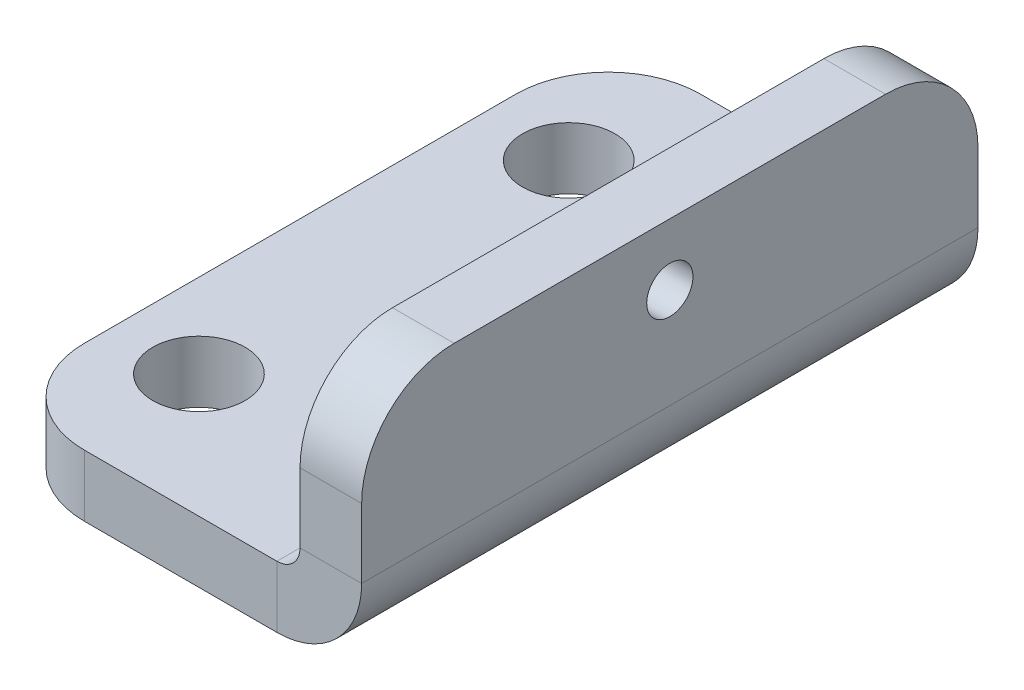
ISO-10303-21;
HEADER;
FILE_DESCRIPTION(('STEP AP214'),'2;1');
FILE_NAME('part.step','',(''),(''),'','','');
FILE_SCHEMA(('AUTOMOTIVE_DESIGN { 1 0 10303 214 1 1 1 1 }'));
ENDSEC;
DATA;
#1=APPLICATION_CONTEXT('core data for automotive mechanical design processes');
#2=APPLICATION_PROTOCOL_DEFINITION('international standard','automotive_design',2000,#1);
#3=PRODUCT_CONTEXT('',#1,'mechanical');
#4=PRODUCT('Part','Part','',(#3));
#5=PRODUCT_RELATED_PRODUCT_CATEGORY('part','',(#4));
#6=PRODUCT_DEFINITION_FORMATION('','',#4);
#7=PRODUCT_DEFINITION_CONTEXT('part definition',#1,'design');
#8=PRODUCT_DEFINITION('design','',#6,#7);
#9=PRODUCT_DEFINITION_SHAPE('','',#8);
#10=(LENGTH_UNIT() NAMED_UNIT(*) SI_UNIT(.MILLI.,.METRE.));
#11=(NAMED_UNIT(*) PLANE_ANGLE_UNIT() SI_UNIT($,.RADIAN.));
#12=(NAMED_UNIT(*) SI_UNIT($,.STERADIAN.) SOLID_ANGLE_UNIT());
#13=UNCERTAINTY_MEASURE_WITH_UNIT(LENGTH_MEASURE(1.E-05),#10,'distance_accuracy_value','');
#14=(GEOMETRIC_REPRESENTATION_CONTEXT(3) GLOBAL_UNCERTAINTY_ASSIGNED_CONTEXT((#13)) GLOBAL_UNIT_ASSIGNED_CONTEXT((#10,
#11,#12)) REPRESENTATION_CONTEXT('',''));
#15=CARTESIAN_POINT('',(0.,0.,0.));
#16=DIRECTION('',(0.,0.,1.));
#17=DIRECTION('',(1.,0.,0.));
#18=AXIS2_PLACEMENT_3D('',#15,#16,#17);
#19=CARTESIAN_POINT('',(3.,2.,7.));
#20=DIRECTION('',(0.,1.,0.));
#21=DIRECTION('',(0.,0.,1.));
#22=AXIS2_PLACEMENT_3D('',#19,#20,#21);
#23=PLANE('',#22);
#24=CARTESIAN_POINT('',(2.72,2.,-6.));
#25=DIRECTION('',(0.,1.,0.));
#26=DIRECTION('',(0.,0.,1.));
#27=AXIS2_PLACEMENT_3D('',#24,#25,#26);
#28=CIRCLE('',#27,1.5);
#29=CARTESIAN_POINT('',(2.72,2.,-4.5));
#30=VERTEX_POINT('',#29);
#31=EDGE_CURVE('E221',#30,#30,#28,.T.);
#32=ORIENTED_EDGE('',*,*,#31,.F.);
#33=EDGE_LOOP('',(#32));
#34=FACE_BOUND('',#33,.T.);
#35=CARTESIAN_POINT('',(2.72,2.,6.));
#36=DIRECTION('',(0.,1.,0.));
#37=DIRECTION('',(0.,0.,1.));
#38=AXIS2_PLACEMENT_3D('',#35,#36,#37);
#39=CIRCLE('',#38,1.5);
#40=CARTESIAN_POINT('',(2.72,2.,7.5));
#41=VERTEX_POINT('',#40);
#42=EDGE_CURVE('E215',#41,#41,#39,.T.);
#43=ORIENTED_EDGE('',*,*,#42,.F.);
#44=EDGE_LOOP('',(#43));
#45=FACE_BOUND('',#44,.T.);
#46=DIRECTION('',(1.,0.,0.));
#47=VECTOR('',#46,1.);
#48=CARTESIAN_POINT('',(3.,2.,10.));
#49=LINE('',#48,#47);
#50=CARTESIAN_POINT('',(3.,2.,10.));
#51=VERTEX_POINT('',#50);
#52=CARTESIAN_POINT('',(9.25,2.,10.));
#53=VERTEX_POINT('',#52);
#54=EDGE_CURVE('E236',#51,#53,#49,.T.);
#55=ORIENTED_EDGE('',*,*,#54,.T.);
#56=DIRECTION('',(0.,0.,-1.));
#57=VECTOR('',#56,1.);
#58=CARTESIAN_POINT('',(9.25,2.,-10.));
#59=LINE('',#58,#57);
#60=CARTESIAN_POINT('',(9.25,2.,-10.));
#61=VERTEX_POINT('',#60);
#62=EDGE_CURVE('E205',#61,#53,#59,.F.);
#63=ORIENTED_EDGE('',*,*,#62,.F.);
#64=DIRECTION('',(-1.,0.,0.));
#65=VECTOR('',#64,1.);
#66=CARTESIAN_POINT('',(3.,2.,-10.));
#67=LINE('',#66,#65);
#68=CARTESIAN_POINT('',(3.,2.,-10.));
#69=VERTEX_POINT('',#68);
#70=EDGE_CURVE('E227',#61,#69,#67,.T.);
#71=ORIENTED_EDGE('',*,*,#70,.T.);
#72=CARTESIAN_POINT('',(3.,2.,-7.));
#73=DIRECTION('',(0.,1.,0.));
#74=DIRECTION('',(0.,0.,-1.));
#75=AXIS2_PLACEMENT_3D('',#72,#73,#74);
#76=CIRCLE('',#75,3.);
#77=CARTESIAN_POINT('',(0.,2.,-7.));
#78=VERTEX_POINT('',#77);
#79=EDGE_CURVE('E229',#69,#78,#76,.T.);
#80=ORIENTED_EDGE('',*,*,#79,.T.);
#81=DIRECTION('',(0.,0.,1.));
#82=VECTOR('',#81,1.);
#83=CARTESIAN_POINT('',(0.,2.,-7.));
#84=LINE('',#83,#82);
#85=CARTESIAN_POINT('',(0.,2.,7.));
#86=VERTEX_POINT('',#85);
#87=EDGE_CURVE('E232',#78,#86,#84,.T.);
#88=ORIENTED_EDGE('',*,*,#87,.T.);
#89=CARTESIAN_POINT('',(3.,2.,7.));
#90=DIRECTION('',(0.,1.,0.));
#91=DIRECTION('',(0.,0.,1.));
#92=AXIS2_PLACEMENT_3D('',#89,#90,#91);
#93=CIRCLE('',#92,3.);
#94=EDGE_CURVE('E234',#86,#51,#93,.T.);
#95=ORIENTED_EDGE('',*,*,#94,.T.);
#96=EDGE_LOOP('',(#55,#63,#71,#80,#88,#95));
#97=FACE_BOUND('',#96,.T.);
#98=ADVANCED_FACE('F61',(#34,#45,#97),#23,.T.);
#99=CARTESIAN_POINT('',(3.,0.,7.));
#100=DIRECTION('',(0.,1.,0.));
#101=DIRECTION('',(0.,0.,1.));
#102=AXIS2_PLACEMENT_3D('',#99,#100,#101);
#103=PLANE('',#102);
#104=CARTESIAN_POINT('',(2.72,0.,6.));
#105=DIRECTION('',(0.,1.,0.));
#106=DIRECTION('',(0.,0.,1.));
#107=AXIS2_PLACEMENT_3D('',#104,#105,#106);
#108=CIRCLE('',#107,1.5);
#109=CARTESIAN_POINT('',(2.72,0.,7.5));
#110=VERTEX_POINT('',#109);
#111=EDGE_CURVE('E212',#110,#110,#108,.T.);
#112=ORIENTED_EDGE('',*,*,#111,.T.);
#113=EDGE_LOOP('',(#112));
#114=FACE_BOUND('',#113,.T.);
#115=CARTESIAN_POINT('',(2.72,0.,-6.));
#116=DIRECTION('',(0.,1.,0.));
#117=DIRECTION('',(0.,0.,1.));
#118=AXIS2_PLACEMENT_3D('',#115,#116,#117);
#119=CIRCLE('',#118,1.5);
#120=CARTESIAN_POINT('',(2.72,0.,-4.5));
#121=VERTEX_POINT('',#120);
#122=EDGE_CURVE('E218',#121,#121,#119,.T.);
#123=ORIENTED_EDGE('',*,*,#122,.T.);
#124=EDGE_LOOP('',(#123));
#125=FACE_BOUND('',#124,.T.);
#126=DIRECTION('',(0.,0.,-1.));
#127=VECTOR('',#126,1.);
#128=CARTESIAN_POINT('',(9.25,0.,-10.));
#129=LINE('',#128,#127);
#130=CARTESIAN_POINT('',(9.25,0.,-10.));
#131=VERTEX_POINT('',#130);
#132=CARTESIAN_POINT('',(9.25,0.,10.));
#133=VERTEX_POINT('',#132);
#134=EDGE_CURVE('E161',#131,#133,#129,.F.);
#135=ORIENTED_EDGE('',*,*,#134,.T.);
#136=DIRECTION('',(1.,0.,0.));
#137=VECTOR('',#136,1.);
#138=CARTESIAN_POINT('',(3.,0.,10.));
#139=LINE('',#138,#137);
#140=CARTESIAN_POINT('',(3.,0.,10.));
#141=VERTEX_POINT('',#140);
#142=EDGE_CURVE('E230',#141,#133,#139,.T.);
#143=ORIENTED_EDGE('',*,*,#142,.F.);
#144=CARTESIAN_POINT('',(3.,0.,7.));
#145=DIRECTION('',(0.,1.,0.));
#146=DIRECTION('',(0.,0.,1.));
#147=AXIS2_PLACEMENT_3D('',#144,#145,#146);
#148=CIRCLE('',#147,3.);
#149=CARTESIAN_POINT('',(0.,0.,7.));
#150=VERTEX_POINT('',#149);
#151=EDGE_CURVE('E245',#150,#141,#148,.T.);
#152=ORIENTED_EDGE('',*,*,#151,.F.);
#153=DIRECTION('',(0.,0.,1.));
#154=VECTOR('',#153,1.);
#155=CARTESIAN_POINT('',(0.,0.,-7.));
#156=LINE('',#155,#154);
#157=CARTESIAN_POINT('',(0.,0.,-7.));
#158=VERTEX_POINT('',#157);
#159=EDGE_CURVE('E243',#158,#150,#156,.T.);
#160=ORIENTED_EDGE('',*,*,#159,.F.);
#161=CARTESIAN_POINT('',(3.,0.,-7.));
#162=DIRECTION('',(0.,1.,0.));
#163=DIRECTION('',(0.,0.,-1.));
#164=AXIS2_PLACEMENT_3D('',#161,#162,#163);
#165=CIRCLE('',#164,3.);
#166=CARTESIAN_POINT('',(3.,0.,-10.));
#167=VERTEX_POINT('',#166);
#168=EDGE_CURVE('E241',#167,#158,#165,.T.);
#169=ORIENTED_EDGE('',*,*,#168,.F.);
#170=DIRECTION('',(-1.,0.,0.));
#171=VECTOR('',#170,1.);
#172=CARTESIAN_POINT('',(3.,0.,-10.));
#173=LINE('',#172,#171);
#174=EDGE_CURVE('E224',#131,#167,#173,.T.);
#175=ORIENTED_EDGE('',*,*,#174,.F.);
#176=EDGE_LOOP('',(#135,#143,#152,#160,#169,#175));
#177=FACE_BOUND('',#176,.T.);
#178=ADVANCED_FACE('F305',(#114,#125,#177),#103,.F.);
#179=CARTESIAN_POINT('',(3.,2.,-10.));
#180=DIRECTION('',(0.,0.,1.));
#181=DIRECTION('',(1.,0.,0.));
#182=AXIS2_PLACEMENT_3D('',#179,#180,#181);
#183=PLANE('',#182);
#184=DIRECTION('',(0.,-1.,0.));
#185=VECTOR('',#184,1.);
#186=CARTESIAN_POINT('',(9.25,2.,-10.));
#187=LINE('',#186,#185);
#188=EDGE_CURVE('E201',#61,#131,#187,.T.);
#189=ORIENTED_EDGE('',*,*,#188,.T.);
#190=ORIENTED_EDGE('',*,*,#174,.T.);
#191=DIRECTION('',(0.,-1.,0.));
#192=VECTOR('',#191,1.);
#193=CARTESIAN_POINT('',(3.,2.,-10.));
#194=LINE('',#193,#192);
#195=EDGE_CURVE('E256',#69,#167,#194,.T.);
#196=ORIENTED_EDGE('',*,*,#195,.F.);
#197=ORIENTED_EDGE('',*,*,#70,.F.);
#198=EDGE_LOOP('',(#189,#190,#196,#197));
#199=FACE_BOUND('',#198,.T.);
#200=ADVANCED_FACE('F310',(#199),#183,.F.);
#201=CARTESIAN_POINT('',(3.,2.,10.));
#202=DIRECTION('',(0.,0.,-1.));
#203=DIRECTION('',(-1.,0.,0.));
#204=AXIS2_PLACEMENT_3D('',#201,#202,#203);
#205=PLANE('',#204);
#206=DIRECTION('',(0.,-1.,0.));
#207=VECTOR('',#206,1.);
#208=CARTESIAN_POINT('',(9.25,2.,10.));
#209=LINE('',#208,#207);
#210=EDGE_CURVE('E209',#53,#133,#209,.T.);
#211=ORIENTED_EDGE('',*,*,#210,.F.);
#212=ORIENTED_EDGE('',*,*,#54,.F.);
#213=DIRECTION('',(0.,-1.,0.));
#214=VECTOR('',#213,1.);
#215=CARTESIAN_POINT('',(3.,2.,10.));
#216=LINE('',#215,#214);
#217=EDGE_CURVE('E239',#51,#141,#216,.T.);
#218=ORIENTED_EDGE('',*,*,#217,.T.);
#219=ORIENTED_EDGE('',*,*,#142,.T.);
#220=EDGE_LOOP('',(#211,#212,#218,#219));
#221=FACE_BOUND('',#220,.T.);
#222=ADVANCED_FACE('F293',(#221),#205,.F.);
#223=CARTESIAN_POINT('',(3.,2.,-7.));
#224=DIRECTION('',(0.,-1.,0.));
#225=DIRECTION('',(0.,0.,-1.));
#226=AXIS2_PLACEMENT_3D('',#223,#224,#225);
#227=CYLINDRICAL_SURFACE('',#226,3.);
#228=ORIENTED_EDGE('',*,*,#168,.T.);
#229=DIRECTION('',(0.,-1.,0.));
#230=VECTOR('',#229,1.);
#231=CARTESIAN_POINT('',(0.,2.,-7.));
#232=LINE('',#231,#230);
#233=EDGE_CURVE('E253',#78,#158,#232,.T.);
#234=ORIENTED_EDGE('',*,*,#233,.F.);
#235=ORIENTED_EDGE('',*,*,#79,.F.);
#236=ORIENTED_EDGE('',*,*,#195,.T.);
#237=EDGE_LOOP('',(#228,#234,#235,#236));
#238=FACE_BOUND('',#237,.T.);
#239=ADVANCED_FACE('F314',(#238),#227,.T.);
#240=CARTESIAN_POINT('',(0.,2.,-7.));
#241=DIRECTION('',(1.,0.,0.));
#242=DIRECTION('',(0.,0.,-1.));
#243=AXIS2_PLACEMENT_3D('',#240,#241,#242);
#244=PLANE('',#243);
#245=ORIENTED_EDGE('',*,*,#159,.T.);
#246=DIRECTION('',(0.,-1.,0.));
#247=VECTOR('',#246,1.);
#248=CARTESIAN_POINT('',(0.,2.,7.));
#249=LINE('',#248,#247);
#250=EDGE_CURVE('E250',#86,#150,#249,.T.);
#251=ORIENTED_EDGE('',*,*,#250,.F.);
#252=ORIENTED_EDGE('',*,*,#87,.F.);
#253=ORIENTED_EDGE('',*,*,#233,.T.);
#254=EDGE_LOOP('',(#245,#251,#252,#253));
#255=FACE_BOUND('',#254,.T.);
#256=ADVANCED_FACE('F316',(#255),#244,.F.);
#257=CARTESIAN_POINT('',(3.,2.,7.));
#258=DIRECTION('',(0.,-1.,0.));
#259=DIRECTION('',(0.,0.,-1.));
#260=AXIS2_PLACEMENT_3D('',#257,#258,#259);
#261=CYLINDRICAL_SURFACE('',#260,3.);
#262=ORIENTED_EDGE('',*,*,#151,.T.);
#263=ORIENTED_EDGE('',*,*,#217,.F.);
#264=ORIENTED_EDGE('',*,*,#94,.F.);
#265=ORIENTED_EDGE('',*,*,#250,.T.);
#266=EDGE_LOOP('',(#262,#263,#264,#265));
#267=FACE_BOUND('',#266,.T.);
#268=ADVANCED_FACE('F302',(#267),#261,.T.);
#269=CARTESIAN_POINT('',(2.72,2.,-6.));
#270=DIRECTION('',(0.,-1.,0.));
#271=DIRECTION('',(0.,0.,-1.));
#272=AXIS2_PLACEMENT_3D('',#269,#270,#271);
#273=CYLINDRICAL_SURFACE('',#272,1.5);
#274=ORIENTED_EDGE('',*,*,#31,.T.);
#275=EDGE_LOOP('',(#274));
#276=FACE_BOUND('',#275,.T.);
#277=ORIENTED_EDGE('',*,*,#122,.F.);
#278=EDGE_LOOP('',(#277));
#279=FACE_BOUND('',#278,.T.);
#280=ADVANCED_FACE('F323',(#276,#279),#273,.F.);
#281=CARTESIAN_POINT('',(2.72,2.,6.));
#282=DIRECTION('',(0.,-1.,0.));
#283=DIRECTION('',(0.,0.,-1.));
#284=AXIS2_PLACEMENT_3D('',#281,#282,#283);
#285=CYLINDRICAL_SURFACE('',#284,1.5);
#286=ORIENTED_EDGE('',*,*,#42,.T.);
#287=EDGE_LOOP('',(#286));
#288=FACE_BOUND('',#287,.T.);
#289=ORIENTED_EDGE('',*,*,#111,.F.);
#290=EDGE_LOOP('',(#289));
#291=FACE_BOUND('',#290,.T.);
#292=ADVANCED_FACE('F377',(#288,#291),#285,.F.);
#293=CARTESIAN_POINT('',(9.25,2.75,10.));
#294=DIRECTION('',(0.,0.,1.));
#295=DIRECTION('',(1.,0.,0.));
#296=AXIS2_PLACEMENT_3D('',#293,#294,#295);
#297=PLANE('',#296);
#298=DIRECTION('',(-1.,0.,0.));
#299=VECTOR('',#298,1.);
#300=CARTESIAN_POINT('',(12.,2.74999999999999,10.));
#301=LINE('',#300,#299);
#302=CARTESIAN_POINT('',(10.,2.75,10.));
#303=VERTEX_POINT('',#302);
#304=CARTESIAN_POINT('',(12.,2.74999999999999,10.));
#305=VERTEX_POINT('',#304);
#306=EDGE_CURVE('E195',#303,#305,#301,.F.);
#307=ORIENTED_EDGE('',*,*,#306,.F.);
#308=CARTESIAN_POINT('',(9.25,2.75,10.));
#309=DIRECTION('',(0.,0.,-1.));
#310=DIRECTION('',(-1.,0.,0.));
#311=AXIS2_PLACEMENT_3D('',#308,#309,#310);
#312=CIRCLE('',#311,0.750000000000002);
#313=EDGE_CURVE('E164',#53,#303,#312,.F.);
#314=ORIENTED_EDGE('',*,*,#313,.F.);
#315=ORIENTED_EDGE('',*,*,#210,.T.);
#316=CARTESIAN_POINT('',(9.25,2.75,10.));
#317=DIRECTION('',(0.,0.,-1.));
#318=DIRECTION('',(-1.,0.,0.));
#319=AXIS2_PLACEMENT_3D('',#316,#317,#318);
#320=CIRCLE('',#319,2.75);
#321=EDGE_CURVE('E200',#133,#305,#320,.F.);
#322=ORIENTED_EDGE('',*,*,#321,.T.);
#323=EDGE_LOOP('',(#307,#314,#315,#322));
#324=FACE_BOUND('',#323,.T.);
#325=ADVANCED_FACE('F290',(#324),#297,.T.);
#326=CARTESIAN_POINT('',(9.25,2.75,-10.));
#327=DIRECTION('',(0.,0.,1.));
#328=DIRECTION('',(1.,0.,0.));
#329=AXIS2_PLACEMENT_3D('',#326,#327,#328);
#330=PLANE('',#329);
#331=CARTESIAN_POINT('',(9.25,2.75,-10.));
#332=DIRECTION('',(0.,0.,-1.));
#333=DIRECTION('',(-1.,0.,0.));
#334=AXIS2_PLACEMENT_3D('',#331,#332,#333);
#335=CIRCLE('',#334,0.750000000000002);
#336=CARTESIAN_POINT('',(10.,2.75,-10.));
#337=VERTEX_POINT('',#336);
#338=EDGE_CURVE('E171',#337,#61,#335,.T.);
#339=ORIENTED_EDGE('',*,*,#338,.F.);
#340=DIRECTION('',(-1.,0.,0.));
#341=VECTOR('',#340,1.);
#342=CARTESIAN_POINT('',(10.,2.75,-10.));
#343=LINE('',#342,#341);
#344=CARTESIAN_POINT('',(12.,2.74999999999999,-10.));
#345=VERTEX_POINT('',#344);
#346=EDGE_CURVE('E168',#337,#345,#343,.F.);
#347=ORIENTED_EDGE('',*,*,#346,.T.);
#348=CARTESIAN_POINT('',(9.25,2.75,-10.));
#349=DIRECTION('',(0.,0.,-1.));
#350=DIRECTION('',(-1.,0.,0.));
#351=AXIS2_PLACEMENT_3D('',#348,#349,#350);
#352=CIRCLE('',#351,2.75);
#353=EDGE_CURVE('E153',#345,#131,#352,.T.);
#354=ORIENTED_EDGE('',*,*,#353,.T.);
#355=ORIENTED_EDGE('',*,*,#188,.F.);
#356=EDGE_LOOP('',(#339,#347,#354,#355));
#357=FACE_BOUND('',#356,.T.);
#358=ADVANCED_FACE('F169',(#357),#330,.F.);
#359=CARTESIAN_POINT('',(9.25,2.75,-10.));
#360=DIRECTION('',(0.,0.,-1.));
#361=DIRECTION('',(1.,0.,0.));
#362=AXIS2_PLACEMENT_3D('',#359,#360,#361);
#363=CYLINDRICAL_SURFACE('',#362,2.75);
#364=ORIENTED_EDGE('',*,*,#134,.F.);
#365=ORIENTED_EDGE('',*,*,#353,.F.);
#366=DIRECTION('',(0.,0.,-1.));
#367=VECTOR('',#366,1.);
#368=CARTESIAN_POINT('',(12.,2.74999999999999,10.));
#369=LINE('',#368,#367);
#370=EDGE_CURVE('E158',#345,#305,#369,.F.);
#371=ORIENTED_EDGE('',*,*,#370,.T.);
#372=ORIENTED_EDGE('',*,*,#321,.F.);
#373=EDGE_LOOP('',(#364,#365,#371,#372));
#374=FACE_BOUND('',#373,.T.);
#375=ADVANCED_FACE('F155',(#374),#363,.T.);
#376=CARTESIAN_POINT('',(9.25,2.75,-10.));
#377=DIRECTION('',(0.,0.,-1.));
#378=DIRECTION('',(1.,0.,0.));
#379=AXIS2_PLACEMENT_3D('',#376,#377,#378);
#380=CYLINDRICAL_SURFACE('',#379,0.750000000000002);
#381=ORIENTED_EDGE('',*,*,#62,.T.);
#382=ORIENTED_EDGE('',*,*,#313,.T.);
#383=DIRECTION('',(0.,0.,-1.));
#384=VECTOR('',#383,1.);
#385=CARTESIAN_POINT('',(10.,2.75,10.));
#386=LINE('',#385,#384);
#387=EDGE_CURVE('E173',#303,#337,#386,.T.);
#388=ORIENTED_EDGE('',*,*,#387,.T.);
#389=ORIENTED_EDGE('',*,*,#338,.T.);
#390=EDGE_LOOP('',(#381,#382,#388,#389));
#391=FACE_BOUND('',#390,.T.);
#392=ADVANCED_FACE('F287',(#391),#380,.F.);
#393=CARTESIAN_POINT('',(12.,8.,-10.));
#394=DIRECTION('',(0.,0.,1.));
#395=DIRECTION('',(0.,-1.,0.));
#396=AXIS2_PLACEMENT_3D('',#393,#394,#395);
#397=PLANE('',#396);
#398=DIRECTION('',(0.,-1.,0.));
#399=VECTOR('',#398,1.);
#400=CARTESIAN_POINT('',(10.,8.00000000000001,-10.));
#401=LINE('',#400,#399);
#402=CARTESIAN_POINT('',(10.,5.00000000000001,-10.));
#403=VERTEX_POINT('',#402);
#404=EDGE_CURVE('E181',#337,#403,#401,.F.);
#405=ORIENTED_EDGE('',*,*,#404,.T.);
#406=DIRECTION('',(-1.,0.,0.));
#407=VECTOR('',#406,1.);
#408=CARTESIAN_POINT('',(12.,5.,-10.));
#409=LINE('',#408,#407);
#410=CARTESIAN_POINT('',(12.,5.,-10.));
#411=VERTEX_POINT('',#410);
#412=EDGE_CURVE('E13',#403,#411,#409,.F.);
#413=ORIENTED_EDGE('',*,*,#412,.T.);
#414=DIRECTION('',(0.,1.,0.));
#415=VECTOR('',#414,1.);
#416=CARTESIAN_POINT('',(12.,0.,-10.));
#417=LINE('',#416,#415);
#418=EDGE_CURVE('E177',#345,#411,#417,.T.);
#419=ORIENTED_EDGE('',*,*,#418,.F.);
#420=ORIENTED_EDGE('',*,*,#346,.F.);
#421=EDGE_LOOP('',(#405,#413,#419,#420));
#422=FACE_BOUND('',#421,.T.);
#423=ADVANCED_FACE('F183',(#422),#397,.F.);
#424=CARTESIAN_POINT('',(12.,1.99999999999999,10.));
#425=DIRECTION('',(0.,0.,-1.));
#426=DIRECTION('',(0.,1.,0.));
#427=AXIS2_PLACEMENT_3D('',#424,#425,#426);
#428=PLANE('',#427);
#429=DIRECTION('',(0.,-1.,0.));
#430=VECTOR('',#429,1.);
#431=CARTESIAN_POINT('',(12.,0.,10.));
#432=LINE('',#431,#430);
#433=CARTESIAN_POINT('',(12.,5.,10.));
#434=VERTEX_POINT('',#433);
#435=EDGE_CURVE('E180',#434,#305,#432,.T.);
#436=ORIENTED_EDGE('',*,*,#435,.F.);
#437=DIRECTION('',(-1.,0.,0.));
#438=VECTOR('',#437,1.);
#439=CARTESIAN_POINT('',(12.,5.,10.));
#440=LINE('',#439,#438);
#441=CARTESIAN_POINT('',(10.,5.00000000000001,10.));
#442=VERTEX_POINT('',#441);
#443=EDGE_CURVE('E259',#434,#442,#440,.T.);
#444=ORIENTED_EDGE('',*,*,#443,.T.);
#445=DIRECTION('',(0.,1.,0.));
#446=VECTOR('',#445,1.);
#447=CARTESIAN_POINT('',(10.,2.,10.));
#448=LINE('',#447,#446);
#449=EDGE_CURVE('E185',#442,#303,#448,.F.);
#450=ORIENTED_EDGE('',*,*,#449,.T.);
#451=ORIENTED_EDGE('',*,*,#306,.T.);
#452=EDGE_LOOP('',(#436,#444,#450,#451));
#453=FACE_BOUND('',#452,.T.);
#454=ADVANCED_FACE('F275',(#453),#428,.F.);
#455=CARTESIAN_POINT('',(12.,0.,0.));
#456=DIRECTION('',(-1.,0.,0.));
#457=DIRECTION('',(0.,-1.,0.));
#458=AXIS2_PLACEMENT_3D('',#455,#456,#457);
#459=PLANE('',#458);
#460=CARTESIAN_POINT('',(12.,6.,0.));
#461=DIRECTION('',(-1.,0.,0.));
#462=DIRECTION('',(0.,-1.,0.));
#463=AXIS2_PLACEMENT_3D('',#460,#461,#462);
#464=CIRCLE('',#463,0.75);
#465=CARTESIAN_POINT('',(12.,5.25,0.));
#466=VERTEX_POINT('',#465);
#467=EDGE_CURVE('E198',#466,#466,#464,.T.);
#468=ORIENTED_EDGE('',*,*,#467,.T.);
#469=EDGE_LOOP('',(#468));
#470=FACE_BOUND('',#469,.T.);
#471=DIRECTION('',(0.,0.,1.));
#472=VECTOR('',#471,1.);
#473=CARTESIAN_POINT('',(12.,8.,0.));
#474=LINE('',#473,#472);
#475=CARTESIAN_POINT('',(12.,8.,-7.));
#476=VERTEX_POINT('',#475);
#477=CARTESIAN_POINT('',(12.,8.,7.));
#478=VERTEX_POINT('',#477);
#479=EDGE_CURVE('E184',#476,#478,#474,.T.);
#480=ORIENTED_EDGE('',*,*,#479,.T.);
#481=CARTESIAN_POINT('',(12.,5.,7.));
#482=DIRECTION('',(-1.,0.,0.));
#483=DIRECTION('',(0.,-1.,0.));
#484=AXIS2_PLACEMENT_3D('',#481,#482,#483);
#485=CIRCLE('',#484,3.);
#486=EDGE_CURVE('E69',#478,#434,#485,.F.);
#487=ORIENTED_EDGE('',*,*,#486,.T.);
#488=ORIENTED_EDGE('',*,*,#435,.T.);
#489=ORIENTED_EDGE('',*,*,#370,.F.);
#490=ORIENTED_EDGE('',*,*,#418,.T.);
#491=CARTESIAN_POINT('',(12.,5.,-7.));
#492=DIRECTION('',(-1.,0.,0.));
#493=DIRECTION('',(0.,-1.,0.));
#494=AXIS2_PLACEMENT_3D('',#491,#492,#493);
#495=CIRCLE('',#494,3.);
#496=EDGE_CURVE('E270',#411,#476,#495,.F.);
#497=ORIENTED_EDGE('',*,*,#496,.T.);
#498=EDGE_LOOP('',(#480,#487,#488,#489,#490,#497));
#499=FACE_BOUND('',#498,.T.);
#500=ADVANCED_FACE('F176',(#470,#499),#459,.F.);
#501=CARTESIAN_POINT('',(9.99999999999999,0.,0.));
#502=DIRECTION('',(-1.,0.,0.));
#503=DIRECTION('',(0.,-1.,0.));
#504=AXIS2_PLACEMENT_3D('',#501,#502,#503);
#505=PLANE('',#504);
#506=CARTESIAN_POINT('',(10.,6.00000000000001,0.));
#507=DIRECTION('',(-1.,0.,0.));
#508=DIRECTION('',(0.,-1.,0.));
#509=AXIS2_PLACEMENT_3D('',#506,#507,#508);
#510=CIRCLE('',#509,0.75);
#511=CARTESIAN_POINT('',(10.,5.25000000000001,0.));
#512=VERTEX_POINT('',#511);
#513=EDGE_CURVE('E542',#512,#512,#510,.T.);
#514=ORIENTED_EDGE('',*,*,#513,.F.);
#515=EDGE_LOOP('',(#514));
#516=FACE_BOUND('',#515,.T.);
#517=ORIENTED_EDGE('',*,*,#449,.F.);
#518=CARTESIAN_POINT('',(10.,5.00000000000001,7.));
#519=DIRECTION('',(-1.,0.,0.));
#520=DIRECTION('',(0.,-1.,0.));
#521=AXIS2_PLACEMENT_3D('',#518,#519,#520);
#522=CIRCLE('',#521,3.);
#523=CARTESIAN_POINT('',(10.,8.00000000000001,7.));
#524=VERTEX_POINT('',#523);
#525=EDGE_CURVE('E264',#442,#524,#522,.T.);
#526=ORIENTED_EDGE('',*,*,#525,.T.);
#527=DIRECTION('',(0.,0.,-1.));
#528=VECTOR('',#527,1.);
#529=CARTESIAN_POINT('',(10.,8.00000000000001,10.));
#530=LINE('',#529,#528);
#531=CARTESIAN_POINT('',(10.,8.00000000000001,-7.));
#532=VERTEX_POINT('',#531);
#533=EDGE_CURVE('E188',#532,#524,#530,.F.);
#534=ORIENTED_EDGE('',*,*,#533,.F.);
#535=CARTESIAN_POINT('',(10.,5.00000000000001,-7.));
#536=DIRECTION('',(-1.,0.,0.));
#537=DIRECTION('',(0.,-1.,0.));
#538=AXIS2_PLACEMENT_3D('',#535,#536,#537);
#539=CIRCLE('',#538,3.);
#540=EDGE_CURVE('E262',#532,#403,#539,.T.);
#541=ORIENTED_EDGE('',*,*,#540,.T.);
#542=ORIENTED_EDGE('',*,*,#404,.F.);
#543=ORIENTED_EDGE('',*,*,#387,.F.);
#544=EDGE_LOOP('',(#517,#526,#534,#541,#542,#543));
#545=FACE_BOUND('',#544,.T.);
#546=ADVANCED_FACE('F281',(#516,#545),#505,.T.);
#547=CARTESIAN_POINT('',(12.,8.,10.));
#548=DIRECTION('',(0.,-1.,0.));
#549=DIRECTION('',(1.,0.,0.));
#550=AXIS2_PLACEMENT_3D('',#547,#548,#549);
#551=PLANE('',#550);
#552=ORIENTED_EDGE('',*,*,#533,.T.);
#553=DIRECTION('',(-1.,0.,0.));
#554=VECTOR('',#553,1.);
#555=CARTESIAN_POINT('',(12.,8.,7.));
#556=LINE('',#555,#554);
#557=EDGE_CURVE('E82',#524,#478,#556,.F.);
#558=ORIENTED_EDGE('',*,*,#557,.T.);
#559=ORIENTED_EDGE('',*,*,#479,.F.);
#560=DIRECTION('',(-1.,0.,0.));
#561=VECTOR('',#560,1.);
#562=CARTESIAN_POINT('',(12.,8.,-7.));
#563=LINE('',#562,#561);
#564=EDGE_CURVE('E266',#476,#532,#563,.T.);
#565=ORIENTED_EDGE('',*,*,#564,.T.);
#566=EDGE_LOOP('',(#552,#558,#559,#565));
#567=FACE_BOUND('',#566,.T.);
#568=ADVANCED_FACE('F283',(#567),#551,.F.);
#569=CARTESIAN_POINT('',(20.,5.99999999999997,0.));
#570=DIRECTION('',(-1.,0.,0.));
#571=DIRECTION('',(0.,-1.,0.));
#572=AXIS2_PLACEMENT_3D('',#569,#570,#571);
#573=CYLINDRICAL_SURFACE('',#572,0.75);
#574=ORIENTED_EDGE('',*,*,#513,.T.);
#575=EDGE_LOOP('',(#574));
#576=FACE_BOUND('',#575,.T.);
#577=ORIENTED_EDGE('',*,*,#467,.F.);
#578=EDGE_LOOP('',(#577));
#579=FACE_BOUND('',#578,.T.);
#580=ADVANCED_FACE('F347',(#576,#579),#573,.F.);
#581=CARTESIAN_POINT('',(12.,5.,7.));
#582=DIRECTION('',(-1.,0.,0.));
#583=DIRECTION('',(0.,-1.,0.));
#584=AXIS2_PLACEMENT_3D('',#581,#582,#583);
#585=CYLINDRICAL_SURFACE('',#584,3.);
#586=ORIENTED_EDGE('',*,*,#486,.F.);
#587=ORIENTED_EDGE('',*,*,#557,.F.);
#588=ORIENTED_EDGE('',*,*,#525,.F.);
#589=ORIENTED_EDGE('',*,*,#443,.F.);
#590=EDGE_LOOP('',(#586,#587,#588,#589));
#591=FACE_BOUND('',#590,.T.);
#592=ADVANCED_FACE('F278',(#591),#585,.T.);
#593=CARTESIAN_POINT('',(12.,5.,-7.));
#594=DIRECTION('',(-1.,0.,0.));
#595=DIRECTION('',(0.,-1.,0.));
#596=AXIS2_PLACEMENT_3D('',#593,#594,#595);
#597=CYLINDRICAL_SURFACE('',#596,3.);
#598=ORIENTED_EDGE('',*,*,#496,.F.);
#599=ORIENTED_EDGE('',*,*,#412,.F.);
#600=ORIENTED_EDGE('',*,*,#540,.F.);
#601=ORIENTED_EDGE('',*,*,#564,.F.);
#602=EDGE_LOOP('',(#598,#599,#600,#601));
#603=FACE_BOUND('',#602,.T.);
#604=ADVANCED_FACE('F63',(#603),#597,.T.);
#605=CLOSED_SHELL('',(#98,#178,#200,#222,#239,#256,#268,#280,#292,#325,#358,#375,#392,#423,#454,
#500,#546,#568,#580,#592,#604));
#606=MANIFOLD_SOLID_BREP('B2',#605);
#607=ADVANCED_BREP_SHAPE_REPRESENTATION('',(#18,#606),#14);
#608=SHAPE_DEFINITION_REPRESENTATION(#9,#607);
ENDSEC;
END-ISO-10303-21;
